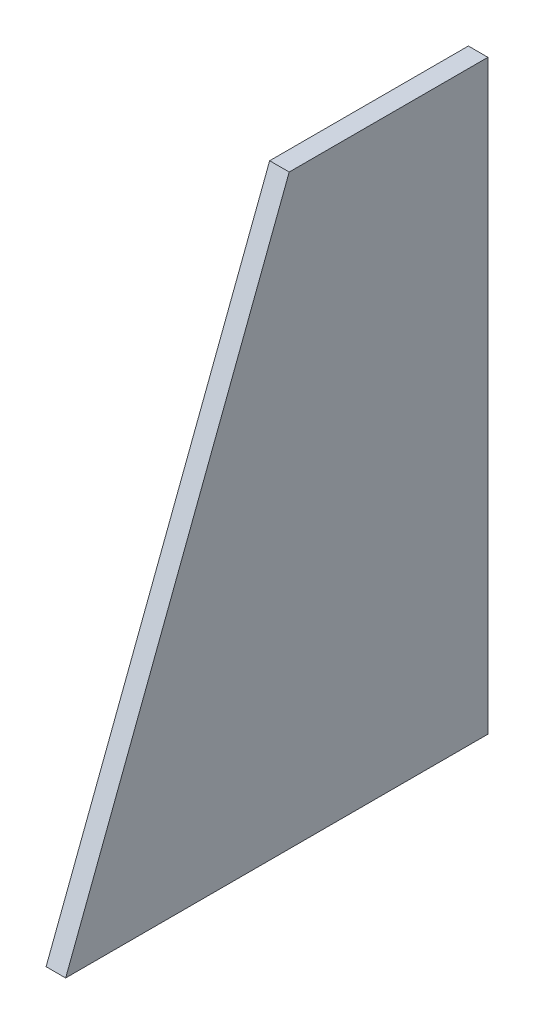
ISO-10303-21;
HEADER;
FILE_DESCRIPTION(('STEP AP214'),'2;1');
FILE_NAME('part.step','',(''),(''),'','','');
FILE_SCHEMA(('AUTOMOTIVE_DESIGN { 1 0 10303 214 1 1 1 1 }'));
ENDSEC;
DATA;
#1=APPLICATION_CONTEXT('core data for automotive mechanical design processes');
#2=APPLICATION_PROTOCOL_DEFINITION('international standard','automotive_design',2000,#1);
#3=PRODUCT_CONTEXT('',#1,'mechanical');
#4=PRODUCT('Part','Part','',(#3));
#5=PRODUCT_RELATED_PRODUCT_CATEGORY('part','',(#4));
#6=PRODUCT_DEFINITION_FORMATION('','',#4);
#7=PRODUCT_DEFINITION_CONTEXT('part definition',#1,'design');
#8=PRODUCT_DEFINITION('design','',#6,#7);
#9=PRODUCT_DEFINITION_SHAPE('','',#8);
#10=(LENGTH_UNIT() NAMED_UNIT(*) SI_UNIT(.MILLI.,.METRE.));
#11=(NAMED_UNIT(*) PLANE_ANGLE_UNIT() SI_UNIT($,.RADIAN.));
#12=(NAMED_UNIT(*) SI_UNIT($,.STERADIAN.) SOLID_ANGLE_UNIT());
#13=UNCERTAINTY_MEASURE_WITH_UNIT(LENGTH_MEASURE(1.E-05),#10,'distance_accuracy_value','');
#14=(GEOMETRIC_REPRESENTATION_CONTEXT(3) GLOBAL_UNCERTAINTY_ASSIGNED_CONTEXT((#13)) GLOBAL_UNIT_ASSIGNED_CONTEXT((#10,
#11,#12)) REPRESENTATION_CONTEXT('',''));
#15=CARTESIAN_POINT('',(0.,0.,0.));
#16=DIRECTION('',(0.,0.,1.));
#17=DIRECTION('',(1.,0.,0.));
#18=AXIS2_PLACEMENT_3D('',#15,#16,#17);
#19=CARTESIAN_POINT('',(2.5,149.86,50.8));
#20=DIRECTION('',(0.,-1.,0.));
#21=DIRECTION('',(0.,0.,-1.));
#22=AXIS2_PLACEMENT_3D('',#19,#20,#21);
#23=PLANE('',#22);
#24=DIRECTION('',(0.,0.,1.));
#25=VECTOR('',#24,1.);
#26=CARTESIAN_POINT('',(-2.5,149.86,50.8));
#27=LINE('',#26,#25);
#28=CARTESIAN_POINT('',(-2.5,149.86,0.));
#29=VERTEX_POINT('',#28);
#30=CARTESIAN_POINT('',(-2.5,149.86,50.8));
#31=VERTEX_POINT('',#30);
#32=EDGE_CURVE('E96',#29,#31,#27,.T.);
#33=ORIENTED_EDGE('',*,*,#32,.T.);
#34=DIRECTION('',(-1.,0.,0.));
#35=VECTOR('',#34,1.);
#36=CARTESIAN_POINT('',(2.5,149.86,50.8));
#37=LINE('',#36,#35);
#38=CARTESIAN_POINT('',(2.5,149.86,50.8));
#39=VERTEX_POINT('',#38);
#40=EDGE_CURVE('E11',#39,#31,#37,.T.);
#41=ORIENTED_EDGE('',*,*,#40,.F.);
#42=DIRECTION('',(0.,0.,1.));
#43=VECTOR('',#42,1.);
#44=CARTESIAN_POINT('',(2.5,149.86,50.8));
#45=LINE('',#44,#43);
#46=CARTESIAN_POINT('',(2.5,149.86,0.));
#47=VERTEX_POINT('',#46);
#48=EDGE_CURVE('E84',#47,#39,#45,.T.);
#49=ORIENTED_EDGE('',*,*,#48,.F.);
#50=DIRECTION('',(-1.,0.,0.));
#51=VECTOR('',#50,1.);
#52=CARTESIAN_POINT('',(2.5,149.86,0.));
#53=LINE('',#52,#51);
#54=EDGE_CURVE('E92',#47,#29,#53,.T.);
#55=ORIENTED_EDGE('',*,*,#54,.T.);
#56=EDGE_LOOP('',(#33,#41,#49,#55));
#57=FACE_BOUND('',#56,.T.);
#58=ADVANCED_FACE('F33',(#57),#23,.F.);
#59=CARTESIAN_POINT('',(2.5,0.,107.95));
#60=DIRECTION('',(0.,-0.356324582333891,-0.93436223811998));
#61=DIRECTION('',(0.,0.93436223811998,-0.356324582333891));
#62=AXIS2_PLACEMENT_3D('',#59,#60,#61);
#63=PLANE('',#62);
#64=DIRECTION('',(0.,-0.93436223811998,0.356324582333891));
#65=VECTOR('',#64,1.);
#66=CARTESIAN_POINT('',(-2.5,0.,107.95));
#67=LINE('',#66,#65);
#68=CARTESIAN_POINT('',(-2.5,0.,107.95));
#69=VERTEX_POINT('',#68);
#70=EDGE_CURVE('E88',#31,#69,#67,.T.);
#71=ORIENTED_EDGE('',*,*,#70,.T.);
#72=DIRECTION('',(-1.,0.,0.));
#73=VECTOR('',#72,1.);
#74=CARTESIAN_POINT('',(2.5,0.,107.95));
#75=LINE('',#74,#73);
#76=CARTESIAN_POINT('',(2.5,0.,107.95));
#77=VERTEX_POINT('',#76);
#78=EDGE_CURVE('E41',#77,#69,#75,.T.);
#79=ORIENTED_EDGE('',*,*,#78,.F.);
#80=DIRECTION('',(0.,-0.93436223811998,0.356324582333891));
#81=VECTOR('',#80,1.);
#82=CARTESIAN_POINT('',(2.5,0.,107.95));
#83=LINE('',#82,#81);
#84=EDGE_CURVE('E79',#39,#77,#83,.T.);
#85=ORIENTED_EDGE('',*,*,#84,.F.);
#86=ORIENTED_EDGE('',*,*,#40,.T.);
#87=EDGE_LOOP('',(#71,#79,#85,#86));
#88=FACE_BOUND('',#87,.T.);
#89=ADVANCED_FACE('F87',(#88),#63,.F.);
#90=CARTESIAN_POINT('',(2.5,0.,0.));
#91=DIRECTION('',(0.,1.,0.));
#92=DIRECTION('',(0.,0.,1.));
#93=AXIS2_PLACEMENT_3D('',#90,#91,#92);
#94=PLANE('',#93);
#95=DIRECTION('',(0.,0.,-1.));
#96=VECTOR('',#95,1.);
#97=CARTESIAN_POINT('',(-2.5,0.,0.));
#98=LINE('',#97,#96);
#99=CARTESIAN_POINT('',(-2.5,0.,0.));
#100=VERTEX_POINT('',#99);
#101=EDGE_CURVE('E66',#69,#100,#98,.T.);
#102=ORIENTED_EDGE('',*,*,#101,.T.);
#103=DIRECTION('',(-1.,0.,0.));
#104=VECTOR('',#103,1.);
#105=CARTESIAN_POINT('',(2.5,0.,0.));
#106=LINE('',#105,#104);
#107=CARTESIAN_POINT('',(2.5,0.,0.));
#108=VERTEX_POINT('',#107);
#109=EDGE_CURVE('E89',#108,#100,#106,.T.);
#110=ORIENTED_EDGE('',*,*,#109,.F.);
#111=DIRECTION('',(0.,0.,-1.));
#112=VECTOR('',#111,1.);
#113=CARTESIAN_POINT('',(2.5,0.,0.));
#114=LINE('',#113,#112);
#115=EDGE_CURVE('E82',#77,#108,#114,.T.);
#116=ORIENTED_EDGE('',*,*,#115,.F.);
#117=ORIENTED_EDGE('',*,*,#78,.T.);
#118=EDGE_LOOP('',(#102,#110,#116,#117));
#119=FACE_BOUND('',#118,.T.);
#120=ADVANCED_FACE('F90',(#119),#94,.F.);
#121=CARTESIAN_POINT('',(2.5,149.86,0.));
#122=DIRECTION('',(0.,0.,1.));
#123=DIRECTION('',(0.,-1.,0.));
#124=AXIS2_PLACEMENT_3D('',#121,#122,#123);
#125=PLANE('',#124);
#126=DIRECTION('',(0.,1.,0.));
#127=VECTOR('',#126,1.);
#128=CARTESIAN_POINT('',(-2.5,149.86,0.));
#129=LINE('',#128,#127);
#130=EDGE_CURVE('E72',#100,#29,#129,.T.);
#131=ORIENTED_EDGE('',*,*,#130,.T.);
#132=ORIENTED_EDGE('',*,*,#54,.F.);
#133=DIRECTION('',(0.,1.,0.));
#134=VECTOR('',#133,1.);
#135=CARTESIAN_POINT('',(2.5,149.86,0.));
#136=LINE('',#135,#134);
#137=EDGE_CURVE('E49',#108,#47,#136,.T.);
#138=ORIENTED_EDGE('',*,*,#137,.F.);
#139=ORIENTED_EDGE('',*,*,#109,.T.);
#140=EDGE_LOOP('',(#131,#132,#138,#139));
#141=FACE_BOUND('',#140,.T.);
#142=ADVANCED_FACE('F103',(#141),#125,.F.);
#143=CARTESIAN_POINT('',(2.5,0.,0.));
#144=DIRECTION('',(-1.,0.,0.));
#145=DIRECTION('',(0.,0.,1.));
#146=AXIS2_PLACEMENT_3D('',#143,#144,#145);
#147=PLANE('',#146);
#148=ORIENTED_EDGE('',*,*,#48,.T.);
#149=ORIENTED_EDGE('',*,*,#84,.T.);
#150=ORIENTED_EDGE('',*,*,#115,.T.);
#151=ORIENTED_EDGE('',*,*,#137,.T.);
#152=EDGE_LOOP('',(#148,#149,#150,#151));
#153=FACE_BOUND('',#152,.T.);
#154=ADVANCED_FACE('F80',(#153),#147,.F.);
#155=CARTESIAN_POINT('',(-2.5,0.,0.));
#156=DIRECTION('',(-1.,0.,0.));
#157=DIRECTION('',(0.,0.,1.));
#158=AXIS2_PLACEMENT_3D('',#155,#156,#157);
#159=PLANE('',#158);
#160=ORIENTED_EDGE('',*,*,#32,.F.);
#161=ORIENTED_EDGE('',*,*,#130,.F.);
#162=ORIENTED_EDGE('',*,*,#101,.F.);
#163=ORIENTED_EDGE('',*,*,#70,.F.);
#164=EDGE_LOOP('',(#160,#161,#162,#163));
#165=FACE_BOUND('',#164,.T.);
#166=ADVANCED_FACE('F106',(#165),#159,.T.);
#167=CLOSED_SHELL('',(#58,#89,#120,#142,#154,#166));
#168=MANIFOLD_SOLID_BREP('B2',#167);
#169=ADVANCED_BREP_SHAPE_REPRESENTATION('',(#18,#168),#14);
#170=SHAPE_DEFINITION_REPRESENTATION(#9,#169);
ENDSEC;
END-ISO-10303-21;
